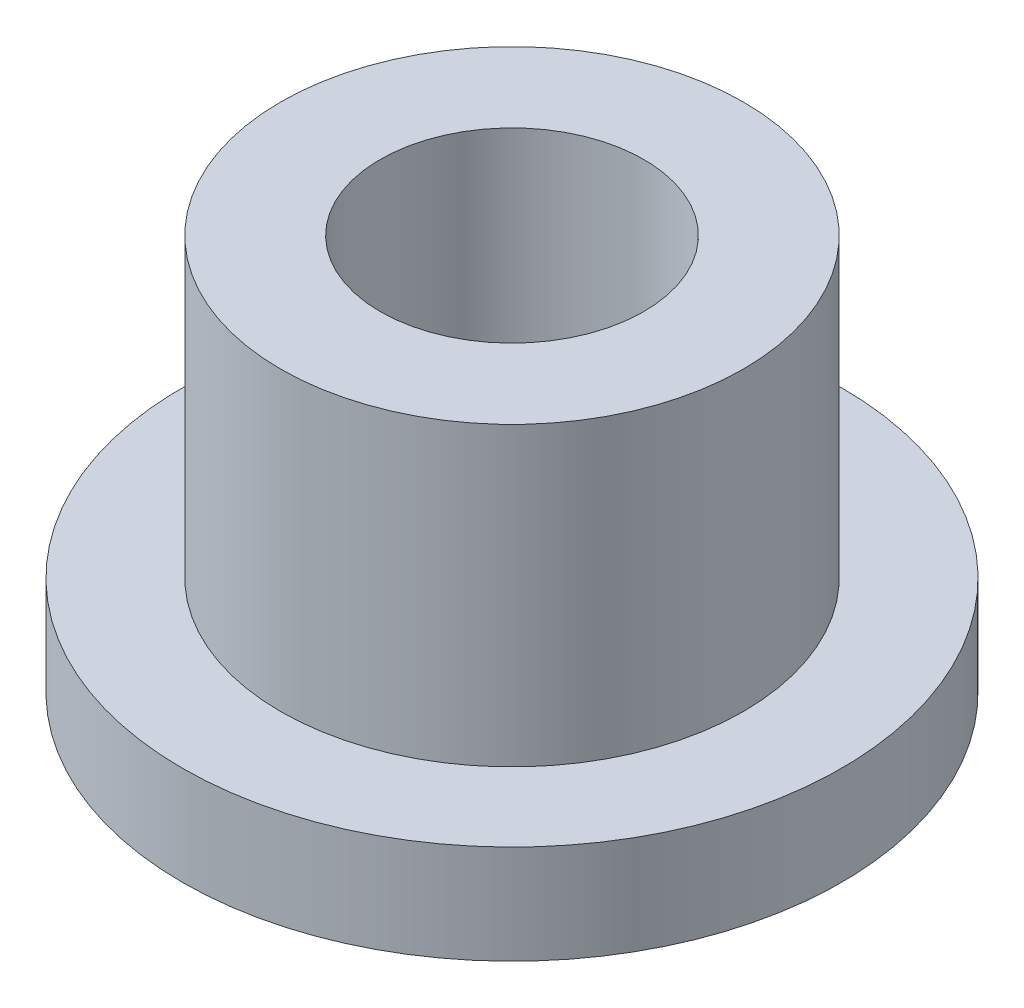
ISO-10303-21;
HEADER;
FILE_DESCRIPTION(('STEP AP214'),'2;1');
FILE_NAME('part.step','',(''),(''),'','','');
FILE_SCHEMA(('AUTOMOTIVE_DESIGN { 1 0 10303 214 1 1 1 1 }'));
ENDSEC;
DATA;
#1=APPLICATION_CONTEXT('core data for automotive mechanical design processes');
#2=APPLICATION_PROTOCOL_DEFINITION('international standard','automotive_design',2000,#1);
#3=PRODUCT_CONTEXT('',#1,'mechanical');
#4=PRODUCT('Part','Part','',(#3));
#5=PRODUCT_RELATED_PRODUCT_CATEGORY('part','',(#4));
#6=PRODUCT_DEFINITION_FORMATION('','',#4);
#7=PRODUCT_DEFINITION_CONTEXT('part definition',#1,'design');
#8=PRODUCT_DEFINITION('design','',#6,#7);
#9=PRODUCT_DEFINITION_SHAPE('','',#8);
#10=(LENGTH_UNIT() NAMED_UNIT(*) SI_UNIT(.MILLI.,.METRE.));
#11=(NAMED_UNIT(*) PLANE_ANGLE_UNIT() SI_UNIT($,.RADIAN.));
#12=(NAMED_UNIT(*) SI_UNIT($,.STERADIAN.) SOLID_ANGLE_UNIT());
#13=UNCERTAINTY_MEASURE_WITH_UNIT(LENGTH_MEASURE(1.E-05),#10,'distance_accuracy_value','');
#14=(GEOMETRIC_REPRESENTATION_CONTEXT(3) GLOBAL_UNCERTAINTY_ASSIGNED_CONTEXT((#13)) GLOBAL_UNIT_ASSIGNED_CONTEXT((#10,
#11,#12)) REPRESENTATION_CONTEXT('',''));
#15=CARTESIAN_POINT('',(0.,0.,0.));
#16=DIRECTION('',(0.,0.,1.));
#17=DIRECTION('',(1.,0.,0.));
#18=AXIS2_PLACEMENT_3D('',#15,#16,#17);
#19=CARTESIAN_POINT('',(0.,3.,0.));
#20=DIRECTION('',(0.,1.,0.));
#21=DIRECTION('',(0.,0.,1.));
#22=AXIS2_PLACEMENT_3D('',#19,#20,#21);
#23=PLANE('',#22);
#24=CARTESIAN_POINT('',(0.,3.,0.));
#25=DIRECTION('',(0.,1.,0.));
#26=DIRECTION('',(0.,0.,1.));
#27=AXIS2_PLACEMENT_3D('',#24,#25,#26);
#28=CIRCLE('',#27,3.51);
#29=CARTESIAN_POINT('',(0.,3.,3.51));
#30=VERTEX_POINT('',#29);
#31=EDGE_CURVE('E10',#30,#30,#28,.T.);
#32=ORIENTED_EDGE('',*,*,#31,.T.);
#33=EDGE_LOOP('',(#32));
#34=FACE_BOUND('',#33,.T.);
#35=CARTESIAN_POINT('',(0.,3.,0.));
#36=DIRECTION('',(0.,1.,0.));
#37=DIRECTION('',(0.,0.,1.));
#38=AXIS2_PLACEMENT_3D('',#35,#36,#37);
#39=CIRCLE('',#38,2.);
#40=CARTESIAN_POINT('',(0.,3.,2.));
#41=VERTEX_POINT('',#40);
#42=EDGE_CURVE('E49',#41,#41,#39,.T.);
#43=ORIENTED_EDGE('',*,*,#42,.F.);
#44=EDGE_LOOP('',(#43));
#45=FACE_BOUND('',#44,.T.);
#46=ADVANCED_FACE('F41',(#34,#45),#23,.T.);
#47=CARTESIAN_POINT('',(0.,3.,0.));
#48=DIRECTION('',(0.,-1.,0.));
#49=DIRECTION('',(0.,0.,-1.));
#50=AXIS2_PLACEMENT_3D('',#47,#48,#49);
#51=CYLINDRICAL_SURFACE('',#50,3.51);
#52=CARTESIAN_POINT('',(0.,-1.5,0.));
#53=DIRECTION('',(0.,1.,0.));
#54=DIRECTION('',(0.,0.,1.));
#55=AXIS2_PLACEMENT_3D('',#52,#53,#54);
#56=CIRCLE('',#55,3.51);
#57=CARTESIAN_POINT('',(0.,-1.5,3.51));
#58=VERTEX_POINT('',#57);
#59=EDGE_CURVE('E66',#58,#58,#56,.T.);
#60=ORIENTED_EDGE('',*,*,#59,.T.);
#61=EDGE_LOOP('',(#60));
#62=FACE_BOUND('',#61,.T.);
#63=ORIENTED_EDGE('',*,*,#31,.F.);
#64=EDGE_LOOP('',(#63));
#65=FACE_BOUND('',#64,.T.);
#66=ADVANCED_FACE('F43',(#62,#65),#51,.T.);
#67=CARTESIAN_POINT('',(0.,3.,0.));
#68=DIRECTION('',(0.,-1.,0.));
#69=DIRECTION('',(0.,0.,-1.));
#70=AXIS2_PLACEMENT_3D('',#67,#68,#69);
#71=CYLINDRICAL_SURFACE('',#70,2.);
#72=ORIENTED_EDGE('',*,*,#42,.T.);
#73=EDGE_LOOP('',(#72));
#74=FACE_BOUND('',#73,.T.);
#75=CARTESIAN_POINT('',(0.,-3.,0.));
#76=DIRECTION('',(0.,1.,0.));
#77=DIRECTION('',(0.,0.,1.));
#78=AXIS2_PLACEMENT_3D('',#75,#76,#77);
#79=CIRCLE('',#78,2.);
#80=CARTESIAN_POINT('',(0.,-3.,2.));
#81=VERTEX_POINT('',#80);
#82=EDGE_CURVE('E54',#81,#81,#79,.T.);
#83=ORIENTED_EDGE('',*,*,#82,.F.);
#84=EDGE_LOOP('',(#83));
#85=FACE_BOUND('',#84,.T.);
#86=ADVANCED_FACE('F88',(#74,#85),#71,.F.);
#87=CARTESIAN_POINT('',(0.,-3.,0.));
#88=DIRECTION('',(0.,1.,0.));
#89=DIRECTION('',(0.,0.,1.));
#90=AXIS2_PLACEMENT_3D('',#87,#88,#89);
#91=PLANE('',#90);
#92=ORIENTED_EDGE('',*,*,#82,.T.);
#93=EDGE_LOOP('',(#92));
#94=FACE_BOUND('',#93,.T.);
#95=CARTESIAN_POINT('',(0.,-3.,0.));
#96=DIRECTION('',(0.,1.,0.));
#97=DIRECTION('',(0.,0.,1.));
#98=AXIS2_PLACEMENT_3D('',#95,#96,#97);
#99=CIRCLE('',#98,5.);
#100=CARTESIAN_POINT('',(0.,-3.,5.));
#101=VERTEX_POINT('',#100);
#102=EDGE_CURVE('E62',#101,#101,#99,.T.);
#103=ORIENTED_EDGE('',*,*,#102,.F.);
#104=EDGE_LOOP('',(#103));
#105=FACE_BOUND('',#104,.T.);
#106=ADVANCED_FACE('F79',(#94,#105),#91,.F.);
#107=CARTESIAN_POINT('',(0.,-1.5,0.));
#108=DIRECTION('',(0.,1.,0.));
#109=DIRECTION('',(0.,0.,1.));
#110=AXIS2_PLACEMENT_3D('',#107,#108,#109);
#111=PLANE('',#110);
#112=CARTESIAN_POINT('',(0.,-1.5,0.));
#113=DIRECTION('',(0.,1.,0.));
#114=DIRECTION('',(0.,0.,1.));
#115=AXIS2_PLACEMENT_3D('',#112,#113,#114);
#116=CIRCLE('',#115,5.);
#117=CARTESIAN_POINT('',(0.,-1.5,5.));
#118=VERTEX_POINT('',#117);
#119=EDGE_CURVE('E59',#118,#118,#116,.T.);
#120=ORIENTED_EDGE('',*,*,#119,.T.);
#121=EDGE_LOOP('',(#120));
#122=FACE_BOUND('',#121,.T.);
#123=ORIENTED_EDGE('',*,*,#59,.F.);
#124=EDGE_LOOP('',(#123));
#125=FACE_BOUND('',#124,.T.);
#126=ADVANCED_FACE('F76',(#122,#125),#111,.T.);
#127=CARTESIAN_POINT('',(0.,-1.5,0.));
#128=DIRECTION('',(0.,-1.,0.));
#129=DIRECTION('',(0.,0.,-1.));
#130=AXIS2_PLACEMENT_3D('',#127,#128,#129);
#131=CYLINDRICAL_SURFACE('',#130,5.);
#132=ORIENTED_EDGE('',*,*,#119,.F.);
#133=EDGE_LOOP('',(#132));
#134=FACE_BOUND('',#133,.T.);
#135=ORIENTED_EDGE('',*,*,#102,.T.);
#136=EDGE_LOOP('',(#135));
#137=FACE_BOUND('',#136,.T.);
#138=ADVANCED_FACE('F78',(#134,#137),#131,.T.);
#139=CLOSED_SHELL('',(#46,#66,#86,#106,#126,#138));
#140=MANIFOLD_SOLID_BREP('B2',#139);
#141=ADVANCED_BREP_SHAPE_REPRESENTATION('',(#18,#140),#14);
#142=SHAPE_DEFINITION_REPRESENTATION(#9,#141);
ENDSEC;
END-ISO-10303-21;
